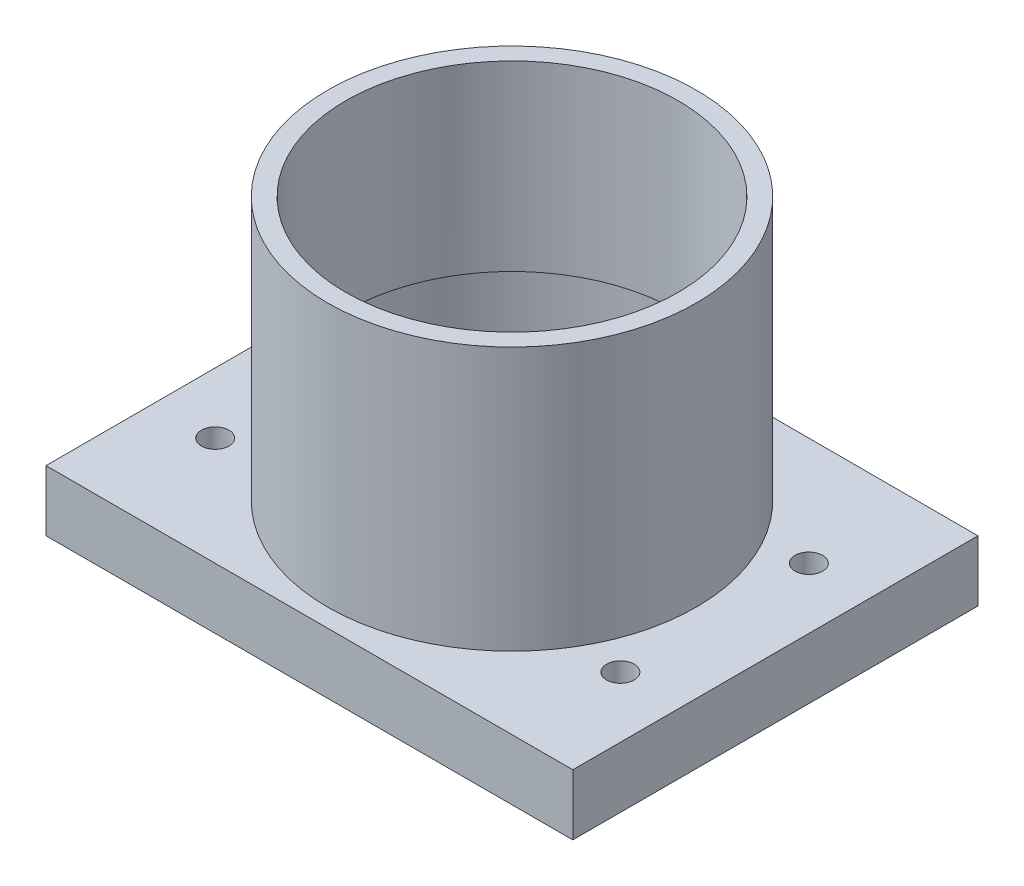
ISO-10303-21;
HEADER;
FILE_DESCRIPTION(('STEP AP214'),'2;1');
FILE_NAME('part.step','',(''),(''),'','','');
FILE_SCHEMA(('AUTOMOTIVE_DESIGN { 1 0 10303 214 1 1 1 1 }'));
ENDSEC;
DATA;
#1=APPLICATION_CONTEXT('core data for automotive mechanical design processes');
#2=APPLICATION_PROTOCOL_DEFINITION('international standard','automotive_design',2000,#1);
#3=PRODUCT_CONTEXT('',#1,'mechanical');
#4=PRODUCT('Part','Part','',(#3));
#5=PRODUCT_RELATED_PRODUCT_CATEGORY('part','',(#4));
#6=PRODUCT_DEFINITION_FORMATION('','',#4);
#7=PRODUCT_DEFINITION_CONTEXT('part definition',#1,'design');
#8=PRODUCT_DEFINITION('design','',#6,#7);
#9=PRODUCT_DEFINITION_SHAPE('','',#8);
#10=(LENGTH_UNIT() NAMED_UNIT(*) SI_UNIT(.MILLI.,.METRE.));
#11=(NAMED_UNIT(*) PLANE_ANGLE_UNIT() SI_UNIT($,.RADIAN.));
#12=(NAMED_UNIT(*) SI_UNIT($,.STERADIAN.) SOLID_ANGLE_UNIT());
#13=UNCERTAINTY_MEASURE_WITH_UNIT(LENGTH_MEASURE(1.E-05),#10,'distance_accuracy_value','');
#14=(GEOMETRIC_REPRESENTATION_CONTEXT(3) GLOBAL_UNCERTAINTY_ASSIGNED_CONTEXT((#13)) GLOBAL_UNIT_ASSIGNED_CONTEXT((#10,
#11,#12)) REPRESENTATION_CONTEXT('',''));
#15=CARTESIAN_POINT('',(0.,0.,0.));
#16=DIRECTION('',(0.,0.,1.));
#17=DIRECTION('',(1.,0.,0.));
#18=AXIS2_PLACEMENT_3D('',#15,#16,#17);
#19=CARTESIAN_POINT('',(0.,0.,0.));
#20=DIRECTION('',(0.,1.,0.));
#21=DIRECTION('',(0.,0.,1.));
#22=AXIS2_PLACEMENT_3D('',#19,#20,#21);
#23=CYLINDRICAL_SURFACE('',#22,41.);
#24=CARTESIAN_POINT('',(0.,80.,0.));
#25=DIRECTION('',(0.,1.,0.));
#26=DIRECTION('',(0.,0.,1.));
#27=AXIS2_PLACEMENT_3D('',#24,#25,#26);
#28=CIRCLE('',#27,41.);
#29=CARTESIAN_POINT('',(0.,80.,41.));
#30=VERTEX_POINT('',#29);
#31=EDGE_CURVE('E120',#30,#30,#28,.T.);
#32=ORIENTED_EDGE('',*,*,#31,.T.);
#33=EDGE_LOOP('',(#32));
#34=FACE_BOUND('',#33,.T.);
#35=CARTESIAN_POINT('',(0.,35.,0.));
#36=DIRECTION('',(0.,-1.,0.));
#37=DIRECTION('',(0.,0.,-1.));
#38=AXIS2_PLACEMENT_3D('',#35,#36,#37);
#39=CIRCLE('',#38,41.);
#40=CARTESIAN_POINT('',(0.,35.,-41.));
#41=VERTEX_POINT('',#40);
#42=EDGE_CURVE('E117',#41,#41,#39,.F.);
#43=ORIENTED_EDGE('',*,*,#42,.F.);
#44=EDGE_LOOP('',(#43));
#45=FACE_BOUND('',#44,.T.);
#46=ADVANCED_FACE('F38',(#34,#45),#23,.F.);
#47=CARTESIAN_POINT('',(65.,15.,50.));
#48=DIRECTION('',(-1.,0.,0.));
#49=DIRECTION('',(0.,0.,1.));
#50=AXIS2_PLACEMENT_3D('',#47,#48,#49);
#51=PLANE('',#50);
#52=DIRECTION('',(0.,0.,-1.));
#53=VECTOR('',#52,1.);
#54=CARTESIAN_POINT('',(65.,0.,50.));
#55=LINE('',#54,#53);
#56=CARTESIAN_POINT('',(65.,0.,50.));
#57=VERTEX_POINT('',#56);
#58=CARTESIAN_POINT('',(65.,0.,-50.));
#59=VERTEX_POINT('',#58);
#60=EDGE_CURVE('E107',#57,#59,#55,.T.);
#61=ORIENTED_EDGE('',*,*,#60,.T.);
#62=DIRECTION('',(0.,-1.,0.));
#63=VECTOR('',#62,1.);
#64=CARTESIAN_POINT('',(65.,15.,-50.));
#65=LINE('',#64,#63);
#66=CARTESIAN_POINT('',(65.,15.,-50.));
#67=VERTEX_POINT('',#66);
#68=EDGE_CURVE('E48',#67,#59,#65,.T.);
#69=ORIENTED_EDGE('',*,*,#68,.F.);
#70=DIRECTION('',(0.,0.,-1.));
#71=VECTOR('',#70,1.);
#72=CARTESIAN_POINT('',(65.,15.,50.));
#73=LINE('',#72,#71);
#74=CARTESIAN_POINT('',(65.,15.,50.));
#75=VERTEX_POINT('',#74);
#76=EDGE_CURVE('E93',#75,#67,#73,.T.);
#77=ORIENTED_EDGE('',*,*,#76,.F.);
#78=DIRECTION('',(0.,-1.,0.));
#79=VECTOR('',#78,1.);
#80=CARTESIAN_POINT('',(65.,15.,50.));
#81=LINE('',#80,#79);
#82=EDGE_CURVE('E103',#75,#57,#81,.T.);
#83=ORIENTED_EDGE('',*,*,#82,.T.);
#84=EDGE_LOOP('',(#61,#69,#77,#83));
#85=FACE_BOUND('',#84,.T.);
#86=ADVANCED_FACE('F40',(#85),#51,.F.);
#87=CARTESIAN_POINT('',(-65.,15.,-50.));
#88=DIRECTION('',(0.,0.,1.));
#89=DIRECTION('',(1.,0.,0.));
#90=AXIS2_PLACEMENT_3D('',#87,#88,#89);
#91=PLANE('',#90);
#92=DIRECTION('',(-1.,0.,0.));
#93=VECTOR('',#92,1.);
#94=CARTESIAN_POINT('',(-65.,0.,-50.));
#95=LINE('',#94,#93);
#96=CARTESIAN_POINT('',(-65.,0.,-50.));
#97=VERTEX_POINT('',#96);
#98=EDGE_CURVE('E98',#59,#97,#95,.T.);
#99=ORIENTED_EDGE('',*,*,#98,.T.);
#100=DIRECTION('',(0.,-1.,0.));
#101=VECTOR('',#100,1.);
#102=CARTESIAN_POINT('',(-65.,15.,-50.));
#103=LINE('',#102,#101);
#104=CARTESIAN_POINT('',(-65.,15.,-50.));
#105=VERTEX_POINT('',#104);
#106=EDGE_CURVE('E96',#105,#97,#103,.T.);
#107=ORIENTED_EDGE('',*,*,#106,.F.);
#108=DIRECTION('',(-1.,0.,0.));
#109=VECTOR('',#108,1.);
#110=CARTESIAN_POINT('',(-65.,15.,-50.));
#111=LINE('',#110,#109);
#112=EDGE_CURVE('E88',#67,#105,#111,.T.);
#113=ORIENTED_EDGE('',*,*,#112,.F.);
#114=ORIENTED_EDGE('',*,*,#68,.T.);
#115=EDGE_LOOP('',(#99,#107,#113,#114));
#116=FACE_BOUND('',#115,.T.);
#117=ADVANCED_FACE('F97',(#116),#91,.F.);
#118=CARTESIAN_POINT('',(-65.,15.,50.));
#119=DIRECTION('',(1.,0.,0.));
#120=DIRECTION('',(0.,0.,-1.));
#121=AXIS2_PLACEMENT_3D('',#118,#119,#120);
#122=PLANE('',#121);
#123=DIRECTION('',(0.,0.,1.));
#124=VECTOR('',#123,1.);
#125=CARTESIAN_POINT('',(-65.,0.,50.));
#126=LINE('',#125,#124);
#127=CARTESIAN_POINT('',(-65.,0.,50.));
#128=VERTEX_POINT('',#127);
#129=EDGE_CURVE('E74',#97,#128,#126,.T.);
#130=ORIENTED_EDGE('',*,*,#129,.T.);
#131=DIRECTION('',(0.,-1.,0.));
#132=VECTOR('',#131,1.);
#133=CARTESIAN_POINT('',(-65.,15.,50.));
#134=LINE('',#133,#132);
#135=CARTESIAN_POINT('',(-65.,15.,50.));
#136=VERTEX_POINT('',#135);
#137=EDGE_CURVE('E99',#136,#128,#134,.T.);
#138=ORIENTED_EDGE('',*,*,#137,.F.);
#139=DIRECTION('',(0.,0.,1.));
#140=VECTOR('',#139,1.);
#141=CARTESIAN_POINT('',(-65.,15.,50.));
#142=LINE('',#141,#140);
#143=EDGE_CURVE('E91',#105,#136,#142,.T.);
#144=ORIENTED_EDGE('',*,*,#143,.F.);
#145=ORIENTED_EDGE('',*,*,#106,.T.);
#146=EDGE_LOOP('',(#130,#138,#144,#145));
#147=FACE_BOUND('',#146,.T.);
#148=ADVANCED_FACE('F101',(#147),#122,.F.);
#149=CARTESIAN_POINT('',(-65.,15.,50.));
#150=DIRECTION('',(0.,0.,-1.));
#151=DIRECTION('',(-1.,0.,0.));
#152=AXIS2_PLACEMENT_3D('',#149,#150,#151);
#153=PLANE('',#152);
#154=DIRECTION('',(1.,0.,0.));
#155=VECTOR('',#154,1.);
#156=CARTESIAN_POINT('',(-65.,0.,50.));
#157=LINE('',#156,#155);
#158=EDGE_CURVE('E80',#128,#57,#157,.T.);
#159=ORIENTED_EDGE('',*,*,#158,.T.);
#160=ORIENTED_EDGE('',*,*,#82,.F.);
#161=DIRECTION('',(1.,0.,0.));
#162=VECTOR('',#161,1.);
#163=CARTESIAN_POINT('',(-65.,15.,50.));
#164=LINE('',#163,#162);
#165=EDGE_CURVE('E57',#136,#75,#164,.T.);
#166=ORIENTED_EDGE('',*,*,#165,.F.);
#167=ORIENTED_EDGE('',*,*,#137,.T.);
#168=EDGE_LOOP('',(#159,#160,#166,#167));
#169=FACE_BOUND('',#168,.T.);
#170=ADVANCED_FACE('F166',(#169),#153,.F.);
#171=CARTESIAN_POINT('',(0.,15.,0.));
#172=DIRECTION('',(0.,-1.,0.));
#173=DIRECTION('',(0.,0.,-1.));
#174=AXIS2_PLACEMENT_3D('',#171,#172,#173);
#175=PLANE('',#174);
#176=CARTESIAN_POINT('',(-50.,15.,-23.25));
#177=DIRECTION('',(0.,1.,0.));
#178=DIRECTION('',(0.,0.,1.));
#179=AXIS2_PLACEMENT_3D('',#176,#177,#178);
#180=CIRCLE('',#179,3.39999999999999);
#181=CARTESIAN_POINT('',(-50.,15.,-19.85));
#182=VERTEX_POINT('',#181);
#183=EDGE_CURVE('E142',#182,#182,#180,.T.);
#184=ORIENTED_EDGE('',*,*,#183,.F.);
#185=EDGE_LOOP('',(#184));
#186=FACE_BOUND('',#185,.T.);
#187=CARTESIAN_POINT('',(-50.,15.,23.25));
#188=DIRECTION('',(0.,1.,0.));
#189=DIRECTION('',(0.,0.,1.));
#190=AXIS2_PLACEMENT_3D('',#187,#188,#189);
#191=CIRCLE('',#190,3.39999999999999);
#192=CARTESIAN_POINT('',(-50.,15.,26.65));
#193=VERTEX_POINT('',#192);
#194=EDGE_CURVE('E132',#193,#193,#191,.T.);
#195=ORIENTED_EDGE('',*,*,#194,.F.);
#196=EDGE_LOOP('',(#195));
#197=FACE_BOUND('',#196,.T.);
#198=CARTESIAN_POINT('',(50.,15.,23.25));
#199=DIRECTION('',(0.,1.,0.));
#200=DIRECTION('',(0.,0.,1.));
#201=AXIS2_PLACEMENT_3D('',#198,#199,#200);
#202=CIRCLE('',#201,3.39999999999999);
#203=CARTESIAN_POINT('',(50.,15.,26.65));
#204=VERTEX_POINT('',#203);
#205=EDGE_CURVE('E129',#204,#204,#202,.T.);
#206=ORIENTED_EDGE('',*,*,#205,.F.);
#207=EDGE_LOOP('',(#206));
#208=FACE_BOUND('',#207,.T.);
#209=CARTESIAN_POINT('',(50.,15.,-23.25));
#210=DIRECTION('',(0.,1.,0.));
#211=DIRECTION('',(0.,0.,1.));
#212=AXIS2_PLACEMENT_3D('',#209,#210,#211);
#213=CIRCLE('',#212,3.39999999999999);
#214=CARTESIAN_POINT('',(50.,15.,-19.85));
#215=VERTEX_POINT('',#214);
#216=EDGE_CURVE('E126',#215,#215,#213,.T.);
#217=ORIENTED_EDGE('',*,*,#216,.F.);
#218=EDGE_LOOP('',(#217));
#219=FACE_BOUND('',#218,.T.);
#220=CARTESIAN_POINT('',(0.,15.,0.));
#221=DIRECTION('',(0.,1.,0.));
#222=DIRECTION('',(0.,0.,1.));
#223=AXIS2_PLACEMENT_3D('',#220,#221,#222);
#224=CIRCLE('',#223,45.5);
#225=CARTESIAN_POINT('',(0.,15.,45.5));
#226=VERTEX_POINT('',#225);
#227=EDGE_CURVE('E11',#226,#226,#224,.T.);
#228=ORIENTED_EDGE('',*,*,#227,.F.);
#229=EDGE_LOOP('',(#228));
#230=FACE_BOUND('',#229,.T.);
#231=ORIENTED_EDGE('',*,*,#76,.T.);
#232=ORIENTED_EDGE('',*,*,#112,.T.);
#233=ORIENTED_EDGE('',*,*,#143,.T.);
#234=ORIENTED_EDGE('',*,*,#165,.T.);
#235=EDGE_LOOP('',(#231,#232,#233,#234));
#236=FACE_BOUND('',#235,.T.);
#237=ADVANCED_FACE('F89',(#186,#197,#208,#219,#230,#236),#175,.F.);
#238=CARTESIAN_POINT('',(0.,0.,0.));
#239=DIRECTION('',(0.,-1.,0.));
#240=DIRECTION('',(0.,0.,-1.));
#241=AXIS2_PLACEMENT_3D('',#238,#239,#240);
#242=PLANE('',#241);
#243=CARTESIAN_POINT('',(-50.,0.,-23.25));
#244=DIRECTION('',(0.,-1.,0.));
#245=DIRECTION('',(0.,0.,-1.));
#246=AXIS2_PLACEMENT_3D('',#243,#244,#245);
#247=CIRCLE('',#246,3.39999999999999);
#248=CARTESIAN_POINT('',(-50.,0.,-26.65));
#249=VERTEX_POINT('',#248);
#250=EDGE_CURVE('E42',#249,#249,#247,.T.);
#251=ORIENTED_EDGE('',*,*,#250,.F.);
#252=EDGE_LOOP('',(#251));
#253=FACE_BOUND('',#252,.T.);
#254=CARTESIAN_POINT('',(-50.,0.,23.25));
#255=DIRECTION('',(0.,-1.,0.));
#256=DIRECTION('',(0.,0.,-1.));
#257=AXIS2_PLACEMENT_3D('',#254,#255,#256);
#258=CIRCLE('',#257,3.39999999999999);
#259=CARTESIAN_POINT('',(-50.,0.,19.85));
#260=VERTEX_POINT('',#259);
#261=EDGE_CURVE('E130',#260,#260,#258,.T.);
#262=ORIENTED_EDGE('',*,*,#261,.F.);
#263=EDGE_LOOP('',(#262));
#264=FACE_BOUND('',#263,.T.);
#265=CARTESIAN_POINT('',(50.,0.,23.25));
#266=DIRECTION('',(0.,-1.,0.));
#267=DIRECTION('',(0.,0.,-1.));
#268=AXIS2_PLACEMENT_3D('',#265,#266,#267);
#269=CIRCLE('',#268,3.39999999999999);
#270=CARTESIAN_POINT('',(50.,0.,19.85));
#271=VERTEX_POINT('',#270);
#272=EDGE_CURVE('E127',#271,#271,#269,.T.);
#273=ORIENTED_EDGE('',*,*,#272,.F.);
#274=EDGE_LOOP('',(#273));
#275=FACE_BOUND('',#274,.T.);
#276=CARTESIAN_POINT('',(50.,0.,-23.25));
#277=DIRECTION('',(0.,-1.,0.));
#278=DIRECTION('',(0.,0.,-1.));
#279=AXIS2_PLACEMENT_3D('',#276,#277,#278);
#280=CIRCLE('',#279,3.39999999999999);
#281=CARTESIAN_POINT('',(50.,0.,-26.65));
#282=VERTEX_POINT('',#281);
#283=EDGE_CURVE('E122',#282,#282,#280,.T.);
#284=ORIENTED_EDGE('',*,*,#283,.F.);
#285=EDGE_LOOP('',(#284));
#286=FACE_BOUND('',#285,.T.);
#287=CARTESIAN_POINT('',(0.,0.,0.));
#288=DIRECTION('',(0.,-1.,0.));
#289=DIRECTION('',(0.,0.,-1.));
#290=AXIS2_PLACEMENT_3D('',#287,#288,#289);
#291=CIRCLE('',#290,42.5);
#292=CARTESIAN_POINT('',(0.,0.,-42.5));
#293=VERTEX_POINT('',#292);
#294=EDGE_CURVE('E125',#293,#293,#291,.T.);
#295=ORIENTED_EDGE('',*,*,#294,.F.);
#296=EDGE_LOOP('',(#295));
#297=FACE_BOUND('',#296,.T.);
#298=ORIENTED_EDGE('',*,*,#60,.F.);
#299=ORIENTED_EDGE('',*,*,#158,.F.);
#300=ORIENTED_EDGE('',*,*,#129,.F.);
#301=ORIENTED_EDGE('',*,*,#98,.F.);
#302=EDGE_LOOP('',(#298,#299,#300,#301));
#303=FACE_BOUND('',#302,.T.);
#304=ADVANCED_FACE('F161',(#253,#264,#275,#286,#297,#303),#242,.T.);
#305=CARTESIAN_POINT('',(0.,80.,0.));
#306=DIRECTION('',(0.,-1.,0.));
#307=DIRECTION('',(0.,0.,-1.));
#308=AXIS2_PLACEMENT_3D('',#305,#306,#307);
#309=CYLINDRICAL_SURFACE('',#308,45.5);
#310=CARTESIAN_POINT('',(0.,80.,0.));
#311=DIRECTION('',(0.,1.,0.));
#312=DIRECTION('',(0.,0.,1.));
#313=AXIS2_PLACEMENT_3D('',#310,#311,#312);
#314=CIRCLE('',#313,45.5);
#315=CARTESIAN_POINT('',(0.,80.,45.5));
#316=VERTEX_POINT('',#315);
#317=EDGE_CURVE('E110',#316,#316,#314,.T.);
#318=ORIENTED_EDGE('',*,*,#317,.F.);
#319=EDGE_LOOP('',(#318));
#320=FACE_BOUND('',#319,.T.);
#321=ORIENTED_EDGE('',*,*,#227,.T.);
#322=EDGE_LOOP('',(#321));
#323=FACE_BOUND('',#322,.T.);
#324=ADVANCED_FACE('F158',(#320,#323),#309,.T.);
#325=CARTESIAN_POINT('',(0.,80.,0.));
#326=DIRECTION('',(0.,1.,0.));
#327=DIRECTION('',(0.,0.,1.));
#328=AXIS2_PLACEMENT_3D('',#325,#326,#327);
#329=PLANE('',#328);
#330=ORIENTED_EDGE('',*,*,#31,.F.);
#331=EDGE_LOOP('',(#330));
#332=FACE_BOUND('',#331,.T.);
#333=ORIENTED_EDGE('',*,*,#317,.T.);
#334=EDGE_LOOP('',(#333));
#335=FACE_BOUND('',#334,.T.);
#336=ADVANCED_FACE('F156',(#332,#335),#329,.T.);
#337=CARTESIAN_POINT('',(0.,35.,0.));
#338=DIRECTION('',(0.,-1.,0.));
#339=DIRECTION('',(0.,0.,-1.));
#340=AXIS2_PLACEMENT_3D('',#337,#338,#339);
#341=PLANE('',#340);
#342=CARTESIAN_POINT('',(0.,35.,0.));
#343=DIRECTION('',(0.,-1.,0.));
#344=DIRECTION('',(0.,0.,-1.));
#345=AXIS2_PLACEMENT_3D('',#342,#343,#344);
#346=CIRCLE('',#345,42.5);
#347=CARTESIAN_POINT('',(0.,35.,-42.5));
#348=VERTEX_POINT('',#347);
#349=EDGE_CURVE('E121',#348,#348,#346,.T.);
#350=ORIENTED_EDGE('',*,*,#349,.T.);
#351=EDGE_LOOP('',(#350));
#352=FACE_BOUND('',#351,.T.);
#353=ORIENTED_EDGE('',*,*,#42,.T.);
#354=EDGE_LOOP('',(#353));
#355=FACE_BOUND('',#354,.T.);
#356=ADVANCED_FACE('F191',(#352,#355),#341,.T.);
#357=CARTESIAN_POINT('',(0.,35.,0.));
#358=DIRECTION('',(0.,-1.,0.));
#359=DIRECTION('',(0.,0.,-1.));
#360=AXIS2_PLACEMENT_3D('',#357,#358,#359);
#361=CYLINDRICAL_SURFACE('',#360,42.5);
#362=ORIENTED_EDGE('',*,*,#349,.F.);
#363=EDGE_LOOP('',(#362));
#364=FACE_BOUND('',#363,.T.);
#365=ORIENTED_EDGE('',*,*,#294,.T.);
#366=EDGE_LOOP('',(#365));
#367=FACE_BOUND('',#366,.T.);
#368=ADVANCED_FACE('F188',(#364,#367),#361,.F.);
#369=CARTESIAN_POINT('',(50.,15.,-23.25));
#370=DIRECTION('',(0.,1.,0.));
#371=DIRECTION('',(0.,0.,1.));
#372=AXIS2_PLACEMENT_3D('',#369,#370,#371);
#373=CYLINDRICAL_SURFACE('',#372,3.39999999999999);
#374=ORIENTED_EDGE('',*,*,#283,.T.);
#375=EDGE_LOOP('',(#374));
#376=FACE_BOUND('',#375,.T.);
#377=ORIENTED_EDGE('',*,*,#216,.T.);
#378=EDGE_LOOP('',(#377));
#379=FACE_BOUND('',#378,.T.);
#380=ADVANCED_FACE('F201',(#376,#379),#373,.F.);
#381=CARTESIAN_POINT('',(50.,15.,23.25));
#382=DIRECTION('',(0.,1.,0.));
#383=DIRECTION('',(0.,0.,1.));
#384=AXIS2_PLACEMENT_3D('',#381,#382,#383);
#385=CYLINDRICAL_SURFACE('',#384,3.39999999999999);
#386=ORIENTED_EDGE('',*,*,#272,.T.);
#387=EDGE_LOOP('',(#386));
#388=FACE_BOUND('',#387,.T.);
#389=ORIENTED_EDGE('',*,*,#205,.T.);
#390=EDGE_LOOP('',(#389));
#391=FACE_BOUND('',#390,.T.);
#392=ADVANCED_FACE('F207',(#388,#391),#385,.F.);
#393=CARTESIAN_POINT('',(-50.,15.,23.25));
#394=DIRECTION('',(0.,1.,0.));
#395=DIRECTION('',(0.,0.,1.));
#396=AXIS2_PLACEMENT_3D('',#393,#394,#395);
#397=CYLINDRICAL_SURFACE('',#396,3.39999999999999);
#398=ORIENTED_EDGE('',*,*,#261,.T.);
#399=EDGE_LOOP('',(#398));
#400=FACE_BOUND('',#399,.T.);
#401=ORIENTED_EDGE('',*,*,#194,.T.);
#402=EDGE_LOOP('',(#401));
#403=FACE_BOUND('',#402,.T.);
#404=ADVANCED_FACE('F211',(#400,#403),#397,.F.);
#405=CARTESIAN_POINT('',(-50.,15.,-23.25));
#406=DIRECTION('',(0.,1.,0.));
#407=DIRECTION('',(0.,0.,1.));
#408=AXIS2_PLACEMENT_3D('',#405,#406,#407);
#409=CYLINDRICAL_SURFACE('',#408,3.39999999999999);
#410=ORIENTED_EDGE('',*,*,#250,.T.);
#411=EDGE_LOOP('',(#410));
#412=FACE_BOUND('',#411,.T.);
#413=ORIENTED_EDGE('',*,*,#183,.T.);
#414=EDGE_LOOP('',(#413));
#415=FACE_BOUND('',#414,.T.);
#416=ADVANCED_FACE('F215',(#412,#415),#409,.F.);
#417=CLOSED_SHELL('',(#46,#86,#117,#148,#170,#237,#304,#324,#336,#356,#368,#380,#392,#404,#416));
#418=MANIFOLD_SOLID_BREP('B2',#417);
#419=ADVANCED_BREP_SHAPE_REPRESENTATION('',(#18,#418),#14);
#420=SHAPE_DEFINITION_REPRESENTATION(#9,#419);
ENDSEC;
END-ISO-10303-21;
